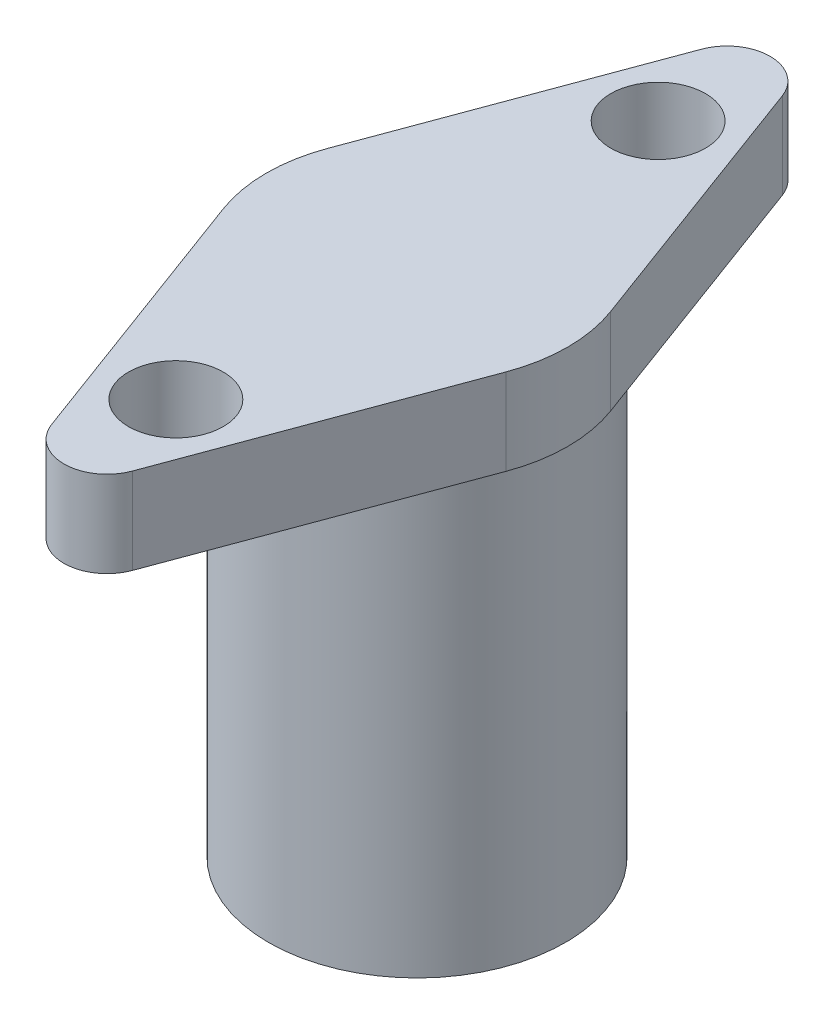
ISO-10303-21;
HEADER;
FILE_DESCRIPTION(('STEP AP214'),'2;1');
FILE_NAME('part.step','',(''),(''),'','','');
FILE_SCHEMA(('AUTOMOTIVE_DESIGN { 1 0 10303 214 1 1 1 1 }'));
ENDSEC;
DATA;
#1=APPLICATION_CONTEXT('core data for automotive mechanical design processes');
#2=APPLICATION_PROTOCOL_DEFINITION('international standard','automotive_design',2000,#1);
#3=PRODUCT_CONTEXT('',#1,'mechanical');
#4=PRODUCT('Part','Part','',(#3));
#5=PRODUCT_RELATED_PRODUCT_CATEGORY('part','',(#4));
#6=PRODUCT_DEFINITION_FORMATION('','',#4);
#7=PRODUCT_DEFINITION_CONTEXT('part definition',#1,'design');
#8=PRODUCT_DEFINITION('design','',#6,#7);
#9=PRODUCT_DEFINITION_SHAPE('','',#8);
#10=(LENGTH_UNIT() NAMED_UNIT(*) SI_UNIT(.MILLI.,.METRE.));
#11=(NAMED_UNIT(*) PLANE_ANGLE_UNIT() SI_UNIT($,.RADIAN.));
#12=(NAMED_UNIT(*) SI_UNIT($,.STERADIAN.) SOLID_ANGLE_UNIT());
#13=UNCERTAINTY_MEASURE_WITH_UNIT(LENGTH_MEASURE(1.E-05),#10,'distance_accuracy_value','');
#14=(GEOMETRIC_REPRESENTATION_CONTEXT(3) GLOBAL_UNCERTAINTY_ASSIGNED_CONTEXT((#13)) GLOBAL_UNIT_ASSIGNED_CONTEXT((#10,
#11,#12)) REPRESENTATION_CONTEXT('',''));
#15=CARTESIAN_POINT('',(0.,0.,0.));
#16=DIRECTION('',(0.,0.,1.));
#17=DIRECTION('',(1.,0.,0.));
#18=AXIS2_PLACEMENT_3D('',#15,#16,#17);
#19=CARTESIAN_POINT('',(0.,0.,0.));
#20=DIRECTION('',(0.,1.,0.));
#21=DIRECTION('',(0.,0.,1.));
#22=AXIS2_PLACEMENT_3D('',#19,#20,#21);
#23=PLANE('',#22);
#24=CARTESIAN_POINT('',(0.,0.,0.));
#25=DIRECTION('',(0.,1.,0.));
#26=DIRECTION('',(0.,0.,1.));
#27=AXIS2_PLACEMENT_3D('',#24,#25,#26);
#28=CIRCLE('',#27,3.45);
#29=CARTESIAN_POINT('',(0.,0.,3.45));
#30=VERTEX_POINT('',#29);
#31=EDGE_CURVE('E39',#30,#30,#28,.T.);
#32=ORIENTED_EDGE('',*,*,#31,.F.);
#33=EDGE_LOOP('',(#32));
#34=FACE_BOUND('',#33,.T.);
#35=CARTESIAN_POINT('',(0.,0.,0.));
#36=DIRECTION('',(0.,1.,0.));
#37=DIRECTION('',(0.,0.,1.));
#38=AXIS2_PLACEMENT_3D('',#35,#36,#37);
#39=CIRCLE('',#38,2.1);
#40=CARTESIAN_POINT('',(0.,0.,2.1));
#41=VERTEX_POINT('',#40);
#42=EDGE_CURVE('E167',#41,#41,#39,.T.);
#43=ORIENTED_EDGE('',*,*,#42,.T.);
#44=EDGE_LOOP('',(#43));
#45=FACE_BOUND('',#44,.T.);
#46=ADVANCED_FACE('F35',(#34,#45),#23,.F.);
#47=CARTESIAN_POINT('',(0.,10.,0.));
#48=DIRECTION('',(0.,-1.,0.));
#49=DIRECTION('',(0.,0.,-1.));
#50=AXIS2_PLACEMENT_3D('',#47,#48,#49);
#51=CYLINDRICAL_SURFACE('',#50,3.45);
#52=CARTESIAN_POINT('',(0.,10.,0.));
#53=DIRECTION('',(0.,1.,0.));
#54=DIRECTION('',(0.,0.,1.));
#55=AXIS2_PLACEMENT_3D('',#52,#53,#54);
#56=CIRCLE('',#55,3.45);
#57=CARTESIAN_POINT('',(0.,10.,3.45));
#58=VERTEX_POINT('',#57);
#59=EDGE_CURVE('E11',#58,#58,#56,.T.);
#60=ORIENTED_EDGE('',*,*,#59,.F.);
#61=EDGE_LOOP('',(#60));
#62=FACE_BOUND('',#61,.T.);
#63=ORIENTED_EDGE('',*,*,#31,.T.);
#64=EDGE_LOOP('',(#63));
#65=FACE_BOUND('',#64,.T.);
#66=ADVANCED_FACE('F37',(#62,#65),#51,.T.);
#67=CARTESIAN_POINT('',(0.,10.,0.));
#68=DIRECTION('',(0.,-1.,0.));
#69=DIRECTION('',(0.,0.,-1.));
#70=AXIS2_PLACEMENT_3D('',#67,#68,#69);
#71=CYLINDRICAL_SURFACE('',#70,2.1);
#72=CARTESIAN_POINT('',(0.,10.,0.));
#73=DIRECTION('',(0.,1.,0.));
#74=DIRECTION('',(0.,0.,1.));
#75=AXIS2_PLACEMENT_3D('',#72,#73,#74);
#76=CIRCLE('',#75,2.1);
#77=CARTESIAN_POINT('',(0.,10.,2.1));
#78=VERTEX_POINT('',#77);
#79=EDGE_CURVE('E164',#78,#78,#76,.T.);
#80=ORIENTED_EDGE('',*,*,#79,.T.);
#81=EDGE_LOOP('',(#80));
#82=FACE_BOUND('',#81,.T.);
#83=ORIENTED_EDGE('',*,*,#42,.F.);
#84=EDGE_LOOP('',(#83));
#85=FACE_BOUND('',#84,.T.);
#86=ADVANCED_FACE('F179',(#82,#85),#71,.F.);
#87=CARTESIAN_POINT('',(0.,10.,0.));
#88=DIRECTION('',(0.,1.,0.));
#89=DIRECTION('',(0.,0.,1.));
#90=AXIS2_PLACEMENT_3D('',#87,#88,#89);
#91=PLANE('',#90);
#92=ORIENTED_EDGE('',*,*,#79,.F.);
#93=EDGE_LOOP('',(#92));
#94=FACE_BOUND('',#93,.T.);
#95=ADVANCED_FACE('F184',(#94),#91,.F.);
#96=CARTESIAN_POINT('',(0.,12.,0.));
#97=DIRECTION('',(0.,1.,0.));
#98=DIRECTION('',(0.,0.,1.));
#99=AXIS2_PLACEMENT_3D('',#96,#97,#98);
#100=PLANE('',#99);
#101=CARTESIAN_POINT('',(0.,12.,-5.6));
#102=DIRECTION('',(0.,1.,0.));
#103=DIRECTION('',(0.,0.,-1.));
#104=AXIS2_PLACEMENT_3D('',#101,#102,#103);
#105=CIRCLE('',#104,1.1);
#106=CARTESIAN_POINT('',(0.,12.,-6.7));
#107=VERTEX_POINT('',#106);
#108=EDGE_CURVE('E138',#107,#107,#105,.T.);
#109=ORIENTED_EDGE('',*,*,#108,.F.);
#110=EDGE_LOOP('',(#109));
#111=FACE_BOUND('',#110,.T.);
#112=CARTESIAN_POINT('',(0.,12.,0.));
#113=DIRECTION('',(0.,1.,0.));
#114=DIRECTION('',(0.,0.,1.));
#115=AXIS2_PLACEMENT_3D('',#112,#113,#114);
#116=CIRCLE('',#115,3.5);
#117=CARTESIAN_POINT('',(-3.28225787327062,12.,-1.21522971217504));
#118=VERTEX_POINT('',#117);
#119=CARTESIAN_POINT('',(-3.28225787327062,12.,1.21522971217504));
#120=VERTEX_POINT('',#119);
#121=EDGE_CURVE('E149',#118,#120,#116,.T.);
#122=ORIENTED_EDGE('',*,*,#121,.T.);
#123=DIRECTION('',(0.34720848919287,0.,0.937787963791605));
#124=VECTOR('',#123,1.);
#125=CARTESIAN_POINT('',(-3.28225787327062,12.,1.21522971217504));
#126=LINE('',#125,#124);
#127=CARTESIAN_POINT('',(-0.937787963791616,12.,7.54749326855284));
#128=VERTEX_POINT('',#127);
#129=EDGE_CURVE('E96',#120,#128,#126,.T.);
#130=ORIENTED_EDGE('',*,*,#129,.T.);
#131=CARTESIAN_POINT('',(0.,12.,7.20028477936));
#132=DIRECTION('',(0.,1.,0.));
#133=DIRECTION('',(0.,0.,1.));
#134=AXIS2_PLACEMENT_3D('',#131,#132,#133);
#135=CIRCLE('',#134,1.);
#136=CARTESIAN_POINT('',(0.937787963791616,12.,7.54749326855284));
#137=VERTEX_POINT('',#136);
#138=EDGE_CURVE('E246',#128,#137,#135,.T.);
#139=ORIENTED_EDGE('',*,*,#138,.T.);
#140=DIRECTION('',(0.34720848919287,0.,-0.937787963791605));
#141=VECTOR('',#140,1.);
#142=CARTESIAN_POINT('',(0.937787963791616,12.,7.54749326855284));
#143=LINE('',#142,#141);
#144=CARTESIAN_POINT('',(3.28225787327062,12.,1.21522971217504));
#145=VERTEX_POINT('',#144);
#146=EDGE_CURVE('E248',#137,#145,#143,.T.);
#147=ORIENTED_EDGE('',*,*,#146,.T.);
#148=CARTESIAN_POINT('',(0.,12.,0.));
#149=DIRECTION('',(0.,1.,0.));
#150=DIRECTION('',(0.,0.,1.));
#151=AXIS2_PLACEMENT_3D('',#148,#149,#150);
#152=CIRCLE('',#151,3.5);
#153=CARTESIAN_POINT('',(3.28225787327062,12.,-1.21522971217504));
#154=VERTEX_POINT('',#153);
#155=EDGE_CURVE('E116',#145,#154,#152,.T.);
#156=ORIENTED_EDGE('',*,*,#155,.T.);
#157=DIRECTION('',(-0.34720848919287,0.,-0.937787963791605));
#158=VECTOR('',#157,1.);
#159=CARTESIAN_POINT('',(0.937787963791616,12.,-7.54749326855284));
#160=LINE('',#159,#158);
#161=CARTESIAN_POINT('',(0.937787963791615,12.,-7.54749326855284));
#162=VERTEX_POINT('',#161);
#163=EDGE_CURVE('E109',#154,#162,#160,.T.);
#164=ORIENTED_EDGE('',*,*,#163,.T.);
#165=CARTESIAN_POINT('',(0.,12.,-7.20028477936));
#166=DIRECTION('',(0.,1.,0.));
#167=DIRECTION('',(0.,0.,-1.));
#168=AXIS2_PLACEMENT_3D('',#165,#166,#167);
#169=CIRCLE('',#168,1.);
#170=CARTESIAN_POINT('',(-0.937787963791616,12.,-7.54749326855284));
#171=VERTEX_POINT('',#170);
#172=EDGE_CURVE('E114',#162,#171,#169,.T.);
#173=ORIENTED_EDGE('',*,*,#172,.T.);
#174=DIRECTION('',(-0.34720848919287,0.,0.937787963791605));
#175=VECTOR('',#174,1.);
#176=CARTESIAN_POINT('',(-3.28225787327062,12.,-1.21522971217504));
#177=LINE('',#176,#175);
#178=EDGE_CURVE('E52',#171,#118,#177,.T.);
#179=ORIENTED_EDGE('',*,*,#178,.T.);
#180=EDGE_LOOP('',(#122,#130,#139,#147,#156,#164,#173,#179));
#181=FACE_BOUND('',#180,.T.);
#182=CARTESIAN_POINT('',(0.,12.,5.6));
#183=DIRECTION('',(0.,1.,0.));
#184=DIRECTION('',(0.,0.,1.));
#185=AXIS2_PLACEMENT_3D('',#182,#183,#184);
#186=CIRCLE('',#185,1.1);
#187=CARTESIAN_POINT('',(0.,12.,6.7));
#188=VERTEX_POINT('',#187);
#189=EDGE_CURVE('E231',#188,#188,#186,.T.);
#190=ORIENTED_EDGE('',*,*,#189,.F.);
#191=EDGE_LOOP('',(#190));
#192=FACE_BOUND('',#191,.T.);
#193=ADVANCED_FACE('F111',(#111,#181,#192),#100,.T.);
#194=ORIENTED_EDGE('',*,*,#59,.T.);
#195=EDGE_LOOP('',(#194));
#196=FACE_BOUND('',#195,.T.);
#197=CARTESIAN_POINT('',(0.,10.,0.));
#198=DIRECTION('',(0.,1.,0.));
#199=DIRECTION('',(0.,0.,1.));
#200=AXIS2_PLACEMENT_3D('',#197,#198,#199);
#201=CIRCLE('',#200,3.5);
#202=CARTESIAN_POINT('',(-3.28225787327062,10.,-1.21522971217504));
#203=VERTEX_POINT('',#202);
#204=CARTESIAN_POINT('',(-3.28225787327062,10.,1.21522971217504));
#205=VERTEX_POINT('',#204);
#206=EDGE_CURVE('E134',#203,#205,#201,.T.);
#207=ORIENTED_EDGE('',*,*,#206,.F.);
#208=DIRECTION('',(-0.34720848919287,0.,0.937787963791605));
#209=VECTOR('',#208,1.);
#210=CARTESIAN_POINT('',(-3.28225787327062,10.,-1.21522971217504));
#211=LINE('',#210,#209);
#212=CARTESIAN_POINT('',(-0.937787963791616,10.,-7.54749326855284));
#213=VERTEX_POINT('',#212);
#214=EDGE_CURVE('E87',#213,#203,#211,.T.);
#215=ORIENTED_EDGE('',*,*,#214,.F.);
#216=CARTESIAN_POINT('',(0.,10.,-7.20028477936));
#217=DIRECTION('',(0.,1.,0.));
#218=DIRECTION('',(0.,0.,-1.));
#219=AXIS2_PLACEMENT_3D('',#216,#217,#218);
#220=CIRCLE('',#219,1.);
#221=CARTESIAN_POINT('',(0.937787963791615,10.,-7.54749326855284));
#222=VERTEX_POINT('',#221);
#223=EDGE_CURVE('E81',#222,#213,#220,.T.);
#224=ORIENTED_EDGE('',*,*,#223,.F.);
#225=DIRECTION('',(-0.34720848919287,0.,-0.937787963791605));
#226=VECTOR('',#225,1.);
#227=CARTESIAN_POINT('',(0.937787963791616,10.,-7.54749326855284));
#228=LINE('',#227,#226);
#229=CARTESIAN_POINT('',(3.28225787327062,10.,-1.21522971217504));
#230=VERTEX_POINT('',#229);
#231=EDGE_CURVE('E124',#230,#222,#228,.T.);
#232=ORIENTED_EDGE('',*,*,#231,.F.);
#233=CARTESIAN_POINT('',(0.,10.,0.));
#234=DIRECTION('',(0.,1.,0.));
#235=DIRECTION('',(0.,0.,1.));
#236=AXIS2_PLACEMENT_3D('',#233,#234,#235);
#237=CIRCLE('',#236,3.5);
#238=CARTESIAN_POINT('',(3.28225787327062,10.,1.21522971217504));
#239=VERTEX_POINT('',#238);
#240=EDGE_CURVE('E144',#239,#230,#237,.T.);
#241=ORIENTED_EDGE('',*,*,#240,.F.);
#242=DIRECTION('',(0.34720848919287,0.,-0.937787963791605));
#243=VECTOR('',#242,1.);
#244=CARTESIAN_POINT('',(0.937787963791616,10.,7.54749326855284));
#245=LINE('',#244,#243);
#246=CARTESIAN_POINT('',(0.937787963791616,10.,7.54749326855284));
#247=VERTEX_POINT('',#246);
#248=EDGE_CURVE('E142',#247,#239,#245,.T.);
#249=ORIENTED_EDGE('',*,*,#248,.F.);
#250=CARTESIAN_POINT('',(0.,10.,7.20028477936));
#251=DIRECTION('',(0.,1.,0.));
#252=DIRECTION('',(0.,0.,1.));
#253=AXIS2_PLACEMENT_3D('',#250,#251,#252);
#254=CIRCLE('',#253,1.);
#255=CARTESIAN_POINT('',(-0.937787963791616,10.,7.54749326855284));
#256=VERTEX_POINT('',#255);
#257=EDGE_CURVE('E140',#256,#247,#254,.T.);
#258=ORIENTED_EDGE('',*,*,#257,.F.);
#259=DIRECTION('',(0.34720848919287,0.,0.937787963791605));
#260=VECTOR('',#259,1.);
#261=CARTESIAN_POINT('',(-3.28225787327062,10.,1.21522971217504));
#262=LINE('',#261,#260);
#263=EDGE_CURVE('E137',#205,#256,#262,.T.);
#264=ORIENTED_EDGE('',*,*,#263,.F.);
#265=EDGE_LOOP('',(#207,#215,#224,#232,#241,#249,#258,#264));
#266=FACE_BOUND('',#265,.T.);
#267=CARTESIAN_POINT('',(0.,10.,-5.6));
#268=DIRECTION('',(0.,1.,0.));
#269=DIRECTION('',(0.,0.,-1.));
#270=AXIS2_PLACEMENT_3D('',#267,#268,#269);
#271=CIRCLE('',#270,1.1);
#272=CARTESIAN_POINT('',(0.,10.,-6.7));
#273=VERTEX_POINT('',#272);
#274=EDGE_CURVE('E237',#273,#273,#271,.T.);
#275=ORIENTED_EDGE('',*,*,#274,.T.);
#276=EDGE_LOOP('',(#275));
#277=FACE_BOUND('',#276,.T.);
#278=CARTESIAN_POINT('',(0.,10.,5.6));
#279=DIRECTION('',(0.,1.,0.));
#280=DIRECTION('',(0.,0.,1.));
#281=AXIS2_PLACEMENT_3D('',#278,#279,#280);
#282=CIRCLE('',#281,1.1);
#283=CARTESIAN_POINT('',(0.,10.,6.7));
#284=VERTEX_POINT('',#283);
#285=EDGE_CURVE('E234',#284,#284,#282,.T.);
#286=ORIENTED_EDGE('',*,*,#285,.T.);
#287=EDGE_LOOP('',(#286));
#288=FACE_BOUND('',#287,.T.);
#289=ADVANCED_FACE('F190',(#196,#266,#277,#288),#91,.F.);
#290=CARTESIAN_POINT('',(0.,12.,0.));
#291=DIRECTION('',(0.,-1.,0.));
#292=DIRECTION('',(0.,0.,-1.));
#293=AXIS2_PLACEMENT_3D('',#290,#291,#292);
#294=CYLINDRICAL_SURFACE('',#293,3.5);
#295=ORIENTED_EDGE('',*,*,#206,.T.);
#296=DIRECTION('',(0.,-1.,0.));
#297=VECTOR('',#296,1.);
#298=CARTESIAN_POINT('',(-3.28225787327062,12.,1.21522971217504));
#299=LINE('',#298,#297);
#300=EDGE_CURVE('E162',#120,#205,#299,.T.);
#301=ORIENTED_EDGE('',*,*,#300,.F.);
#302=ORIENTED_EDGE('',*,*,#121,.F.);
#303=DIRECTION('',(0.,-1.,0.));
#304=VECTOR('',#303,1.);
#305=CARTESIAN_POINT('',(-3.28225787327062,12.,-1.21522971217504));
#306=LINE('',#305,#304);
#307=EDGE_CURVE('E130',#118,#203,#306,.T.);
#308=ORIENTED_EDGE('',*,*,#307,.T.);
#309=EDGE_LOOP('',(#295,#301,#302,#308));
#310=FACE_BOUND('',#309,.T.);
#311=ADVANCED_FACE('F186',(#310),#294,.T.);
#312=CARTESIAN_POINT('',(-3.28225787327062,12.,1.21522971217504));
#313=DIRECTION('',(0.937787963791605,0.,-0.34720848919287));
#314=DIRECTION('',(-0.34720848919287,0.,-0.937787963791605));
#315=AXIS2_PLACEMENT_3D('',#312,#313,#314);
#316=PLANE('',#315);
#317=ORIENTED_EDGE('',*,*,#263,.T.);
#318=DIRECTION('',(0.,-1.,0.));
#319=VECTOR('',#318,1.);
#320=CARTESIAN_POINT('',(-0.937787963791616,12.,7.54749326855284));
#321=LINE('',#320,#319);
#322=EDGE_CURVE('E159',#128,#256,#321,.T.);
#323=ORIENTED_EDGE('',*,*,#322,.F.);
#324=ORIENTED_EDGE('',*,*,#129,.F.);
#325=ORIENTED_EDGE('',*,*,#300,.T.);
#326=EDGE_LOOP('',(#317,#323,#324,#325));
#327=FACE_BOUND('',#326,.T.);
#328=ADVANCED_FACE('F189',(#327),#316,.F.);
#329=CARTESIAN_POINT('',(0.,12.,7.20028477936));
#330=DIRECTION('',(0.,-1.,0.));
#331=DIRECTION('',(0.,0.,-1.));
#332=AXIS2_PLACEMENT_3D('',#329,#330,#331);
#333=CYLINDRICAL_SURFACE('',#332,1.);
#334=ORIENTED_EDGE('',*,*,#257,.T.);
#335=DIRECTION('',(0.,-1.,0.));
#336=VECTOR('',#335,1.);
#337=CARTESIAN_POINT('',(0.937787963791616,12.,7.54749326855284));
#338=LINE('',#337,#336);
#339=EDGE_CURVE('E156',#137,#247,#338,.T.);
#340=ORIENTED_EDGE('',*,*,#339,.F.);
#341=ORIENTED_EDGE('',*,*,#138,.F.);
#342=ORIENTED_EDGE('',*,*,#322,.T.);
#343=EDGE_LOOP('',(#334,#340,#341,#342));
#344=FACE_BOUND('',#343,.T.);
#345=ADVANCED_FACE('F194',(#344),#333,.T.);
#346=CARTESIAN_POINT('',(0.937787963791616,12.,7.54749326855284));
#347=DIRECTION('',(-0.937787963791605,0.,-0.34720848919287));
#348=DIRECTION('',(-0.34720848919287,0.,0.937787963791605));
#349=AXIS2_PLACEMENT_3D('',#346,#347,#348);
#350=PLANE('',#349);
#351=ORIENTED_EDGE('',*,*,#248,.T.);
#352=DIRECTION('',(0.,-1.,0.));
#353=VECTOR('',#352,1.);
#354=CARTESIAN_POINT('',(3.28225787327062,12.,1.21522971217504));
#355=LINE('',#354,#353);
#356=EDGE_CURVE('E153',#145,#239,#355,.T.);
#357=ORIENTED_EDGE('',*,*,#356,.F.);
#358=ORIENTED_EDGE('',*,*,#146,.F.);
#359=ORIENTED_EDGE('',*,*,#339,.T.);
#360=EDGE_LOOP('',(#351,#357,#358,#359));
#361=FACE_BOUND('',#360,.T.);
#362=ADVANCED_FACE('F197',(#361),#350,.F.);
#363=CARTESIAN_POINT('',(0.,12.,0.));
#364=DIRECTION('',(0.,-1.,0.));
#365=DIRECTION('',(0.,0.,-1.));
#366=AXIS2_PLACEMENT_3D('',#363,#364,#365);
#367=CYLINDRICAL_SURFACE('',#366,3.5);
#368=ORIENTED_EDGE('',*,*,#240,.T.);
#369=DIRECTION('',(0.,-1.,0.));
#370=VECTOR('',#369,1.);
#371=CARTESIAN_POINT('',(3.28225787327062,12.,-1.21522971217504));
#372=LINE('',#371,#370);
#373=EDGE_CURVE('E125',#154,#230,#372,.T.);
#374=ORIENTED_EDGE('',*,*,#373,.F.);
#375=ORIENTED_EDGE('',*,*,#155,.F.);
#376=ORIENTED_EDGE('',*,*,#356,.T.);
#377=EDGE_LOOP('',(#368,#374,#375,#376));
#378=FACE_BOUND('',#377,.T.);
#379=ADVANCED_FACE('F201',(#378),#367,.T.);
#380=CARTESIAN_POINT('',(0.937787963791616,12.,-7.54749326855284));
#381=DIRECTION('',(-0.937787963791605,0.,0.34720848919287));
#382=DIRECTION('',(0.34720848919287,0.,0.937787963791605));
#383=AXIS2_PLACEMENT_3D('',#380,#381,#382);
#384=PLANE('',#383);
#385=ORIENTED_EDGE('',*,*,#231,.T.);
#386=DIRECTION('',(0.,-1.,0.));
#387=VECTOR('',#386,1.);
#388=CARTESIAN_POINT('',(0.937787963791615,12.,-7.54749326855284));
#389=LINE('',#388,#387);
#390=EDGE_CURVE('E121',#162,#222,#389,.T.);
#391=ORIENTED_EDGE('',*,*,#390,.F.);
#392=ORIENTED_EDGE('',*,*,#163,.F.);
#393=ORIENTED_EDGE('',*,*,#373,.T.);
#394=EDGE_LOOP('',(#385,#391,#392,#393));
#395=FACE_BOUND('',#394,.T.);
#396=ADVANCED_FACE('F122',(#395),#384,.F.);
#397=CARTESIAN_POINT('',(0.,12.,-7.20028477936));
#398=DIRECTION('',(0.,-1.,0.));
#399=DIRECTION('',(0.,0.,-1.));
#400=AXIS2_PLACEMENT_3D('',#397,#398,#399);
#401=CYLINDRICAL_SURFACE('',#400,1.);
#402=ORIENTED_EDGE('',*,*,#223,.T.);
#403=DIRECTION('',(0.,-1.,0.));
#404=VECTOR('',#403,1.);
#405=CARTESIAN_POINT('',(-0.937787963791616,12.,-7.54749326855284));
#406=LINE('',#405,#404);
#407=EDGE_CURVE('E126',#171,#213,#406,.T.);
#408=ORIENTED_EDGE('',*,*,#407,.F.);
#409=ORIENTED_EDGE('',*,*,#172,.F.);
#410=ORIENTED_EDGE('',*,*,#390,.T.);
#411=EDGE_LOOP('',(#402,#408,#409,#410));
#412=FACE_BOUND('',#411,.T.);
#413=ADVANCED_FACE('F128',(#412),#401,.T.);
#414=CARTESIAN_POINT('',(-3.28225787327062,12.,-1.21522971217504));
#415=DIRECTION('',(0.937787963791605,0.,0.34720848919287));
#416=DIRECTION('',(0.34720848919287,0.,-0.937787963791605));
#417=AXIS2_PLACEMENT_3D('',#414,#415,#416);
#418=PLANE('',#417);
#419=ORIENTED_EDGE('',*,*,#214,.T.);
#420=ORIENTED_EDGE('',*,*,#307,.F.);
#421=ORIENTED_EDGE('',*,*,#178,.F.);
#422=ORIENTED_EDGE('',*,*,#407,.T.);
#423=EDGE_LOOP('',(#419,#420,#421,#422));
#424=FACE_BOUND('',#423,.T.);
#425=ADVANCED_FACE('F210',(#424),#418,.F.);
#426=CARTESIAN_POINT('',(0.,12.,-5.6));
#427=DIRECTION('',(0.,-1.,0.));
#428=DIRECTION('',(0.,0.,-1.));
#429=AXIS2_PLACEMENT_3D('',#426,#427,#428);
#430=CYLINDRICAL_SURFACE('',#429,1.1);
#431=ORIENTED_EDGE('',*,*,#108,.T.);
#432=EDGE_LOOP('',(#431));
#433=FACE_BOUND('',#432,.T.);
#434=ORIENTED_EDGE('',*,*,#274,.F.);
#435=EDGE_LOOP('',(#434));
#436=FACE_BOUND('',#435,.T.);
#437=ADVANCED_FACE('F213',(#433,#436),#430,.F.);
#438=CARTESIAN_POINT('',(0.,12.,5.6));
#439=DIRECTION('',(0.,-1.,0.));
#440=DIRECTION('',(0.,0.,-1.));
#441=AXIS2_PLACEMENT_3D('',#438,#439,#440);
#442=CYLINDRICAL_SURFACE('',#441,1.1);
#443=ORIENTED_EDGE('',*,*,#189,.T.);
#444=EDGE_LOOP('',(#443));
#445=FACE_BOUND('',#444,.T.);
#446=ORIENTED_EDGE('',*,*,#285,.F.);
#447=EDGE_LOOP('',(#446));
#448=FACE_BOUND('',#447,.T.);
#449=ADVANCED_FACE('F222',(#445,#448),#442,.F.);
#450=CLOSED_SHELL('',(#46,#66,#86,#95,#193,#289,#311,#328,#345,#362,#379,#396,#413,#425,#437,#449));
#451=MANIFOLD_SOLID_BREP('B2',#450);
#452=ADVANCED_BREP_SHAPE_REPRESENTATION('',(#18,#451),#14);
#453=SHAPE_DEFINITION_REPRESENTATION(#9,#452);
ENDSEC;
END-ISO-10303-21;
